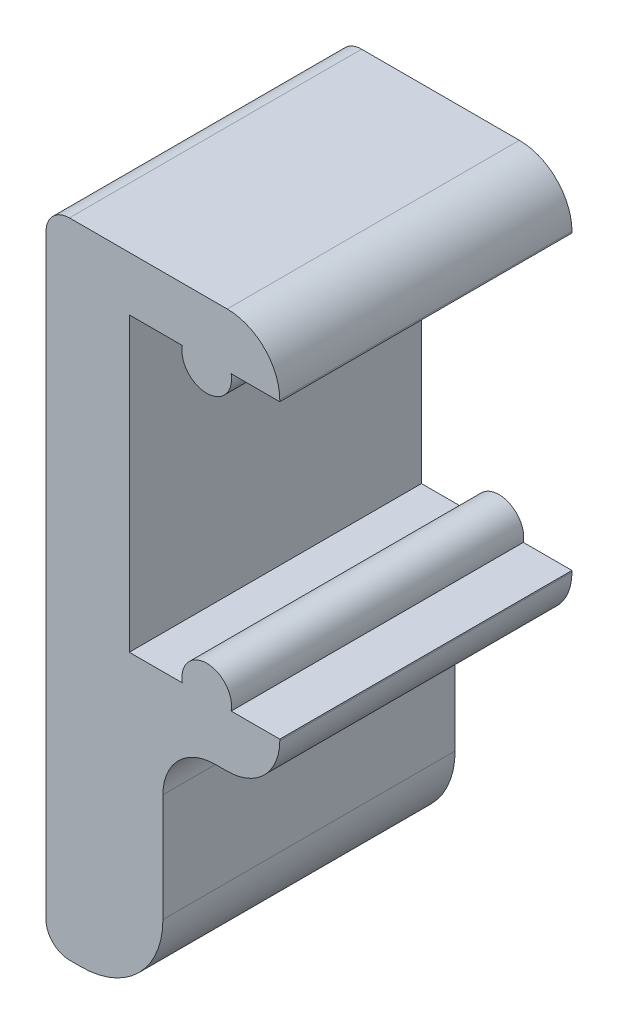
ISO-10303-21;
HEADER;
FILE_DESCRIPTION(('STEP AP214'),'2;1');
FILE_NAME('part.step','',(''),(''),'','','');
FILE_SCHEMA(('AUTOMOTIVE_DESIGN { 1 0 10303 214 1 1 1 1 }'));
ENDSEC;
DATA;
#1=APPLICATION_CONTEXT('core data for automotive mechanical design processes');
#2=APPLICATION_PROTOCOL_DEFINITION('international standard','automotive_design',2000,#1);
#3=PRODUCT_CONTEXT('',#1,'mechanical');
#4=PRODUCT('Part','Part','',(#3));
#5=PRODUCT_RELATED_PRODUCT_CATEGORY('part','',(#4));
#6=PRODUCT_DEFINITION_FORMATION('','',#4);
#7=PRODUCT_DEFINITION_CONTEXT('part definition',#1,'design');
#8=PRODUCT_DEFINITION('design','',#6,#7);
#9=PRODUCT_DEFINITION_SHAPE('','',#8);
#10=(LENGTH_UNIT() NAMED_UNIT(*) SI_UNIT(.MILLI.,.METRE.));
#11=(NAMED_UNIT(*) PLANE_ANGLE_UNIT() SI_UNIT($,.RADIAN.));
#12=(NAMED_UNIT(*) SI_UNIT($,.STERADIAN.) SOLID_ANGLE_UNIT());
#13=UNCERTAINTY_MEASURE_WITH_UNIT(LENGTH_MEASURE(1.E-05),#10,'distance_accuracy_value','');
#14=(GEOMETRIC_REPRESENTATION_CONTEXT(3) GLOBAL_UNCERTAINTY_ASSIGNED_CONTEXT((#13)) GLOBAL_UNIT_ASSIGNED_CONTEXT((#10,
#11,#12)) REPRESENTATION_CONTEXT('',''));
#15=CARTESIAN_POINT('',(0.,0.,0.));
#16=DIRECTION('',(0.,0.,1.));
#17=DIRECTION('',(1.,0.,0.));
#18=AXIS2_PLACEMENT_3D('',#15,#16,#17);
#19=CARTESIAN_POINT('',(0.8,0.8,10.));
#20=DIRECTION('',(0.,0.,-1.));
#21=DIRECTION('',(-1.,0.,0.));
#22=AXIS2_PLACEMENT_3D('',#19,#20,#21);
#23=CYLINDRICAL_SURFACE('',#22,0.8);
#24=CARTESIAN_POINT('',(0.8,0.8,0.));
#25=DIRECTION('',(0.,0.,1.));
#26=DIRECTION('',(1.,0.,0.));
#27=AXIS2_PLACEMENT_3D('',#24,#25,#26);
#28=CIRCLE('',#27,0.8);
#29=CARTESIAN_POINT('',(0.800000000000006,0.,0.));
#30=VERTEX_POINT('',#29);
#31=CARTESIAN_POINT('',(0.,0.800000000000006,0.));
#32=VERTEX_POINT('',#31);
#33=EDGE_CURVE('E201',#30,#32,#28,.F.);
#34=ORIENTED_EDGE('',*,*,#33,.F.);
#35=DIRECTION('',(0.,0.,-1.));
#36=VECTOR('',#35,1.);
#37=CARTESIAN_POINT('',(0.800000000000006,0.,10.));
#38=LINE('',#37,#36);
#39=CARTESIAN_POINT('',(0.800000000000006,0.,10.));
#40=VERTEX_POINT('',#39);
#41=EDGE_CURVE('E11',#40,#30,#38,.T.);
#42=ORIENTED_EDGE('',*,*,#41,.F.);
#43=CARTESIAN_POINT('',(0.8,0.8,10.));
#44=DIRECTION('',(0.,0.,1.));
#45=DIRECTION('',(1.,0.,0.));
#46=AXIS2_PLACEMENT_3D('',#43,#44,#45);
#47=CIRCLE('',#46,0.8);
#48=CARTESIAN_POINT('',(0.,0.800000000000006,10.));
#49=VERTEX_POINT('',#48);
#50=EDGE_CURVE('E253',#40,#49,#47,.F.);
#51=ORIENTED_EDGE('',*,*,#50,.T.);
#52=DIRECTION('',(0.,0.,-1.));
#53=VECTOR('',#52,1.);
#54=CARTESIAN_POINT('',(0.,0.800000000000006,10.));
#55=LINE('',#54,#53);
#56=EDGE_CURVE('E52',#49,#32,#55,.T.);
#57=ORIENTED_EDGE('',*,*,#56,.T.);
#58=EDGE_LOOP('',(#34,#42,#51,#57));
#59=FACE_BOUND('',#58,.T.);
#60=ADVANCED_FACE('F36',(#59),#23,.T.);
#61=CARTESIAN_POINT('',(0.,0.,10.));
#62=DIRECTION('',(0.,-1.,0.));
#63=DIRECTION('',(1.,0.,0.));
#64=AXIS2_PLACEMENT_3D('',#61,#62,#63);
#65=PLANE('',#64);
#66=DIRECTION('',(-1.,0.,0.));
#67=VECTOR('',#66,1.);
#68=CARTESIAN_POINT('',(0.,0.,0.));
#69=LINE('',#68,#67);
#70=CARTESIAN_POINT('',(1.2,0.,0.));
#71=VERTEX_POINT('',#70);
#72=EDGE_CURVE('E203',#71,#30,#69,.T.);
#73=ORIENTED_EDGE('',*,*,#72,.F.);
#74=DIRECTION('',(0.,0.,-1.));
#75=VECTOR('',#74,1.);
#76=CARTESIAN_POINT('',(1.2,0.,10.));
#77=LINE('',#76,#75);
#78=CARTESIAN_POINT('',(1.2,0.,10.));
#79=VERTEX_POINT('',#78);
#80=EDGE_CURVE('E44',#79,#71,#77,.T.);
#81=ORIENTED_EDGE('',*,*,#80,.F.);
#82=DIRECTION('',(-1.,0.,0.));
#83=VECTOR('',#82,1.);
#84=CARTESIAN_POINT('',(0.,0.,10.));
#85=LINE('',#84,#83);
#86=EDGE_CURVE('E305',#79,#40,#85,.T.);
#87=ORIENTED_EDGE('',*,*,#86,.T.);
#88=ORIENTED_EDGE('',*,*,#41,.T.);
#89=EDGE_LOOP('',(#73,#81,#87,#88));
#90=FACE_BOUND('',#89,.T.);
#91=ADVANCED_FACE('F294',(#90),#65,.T.);
#92=CARTESIAN_POINT('',(1.2,2.8,10.));
#93=DIRECTION('',(0.,0.,-1.));
#94=DIRECTION('',(-1.,0.,0.));
#95=AXIS2_PLACEMENT_3D('',#92,#93,#94);
#96=CYLINDRICAL_SURFACE('',#95,2.8);
#97=CARTESIAN_POINT('',(1.2,2.8,0.));
#98=DIRECTION('',(0.,0.,1.));
#99=DIRECTION('',(1.,0.,0.));
#100=AXIS2_PLACEMENT_3D('',#97,#98,#99);
#101=CIRCLE('',#100,2.8);
#102=CARTESIAN_POINT('',(4.,2.8,0.));
#103=VERTEX_POINT('',#102);
#104=EDGE_CURVE('E206',#103,#71,#101,.F.);
#105=ORIENTED_EDGE('',*,*,#104,.F.);
#106=DIRECTION('',(0.,0.,-1.));
#107=VECTOR('',#106,1.);
#108=CARTESIAN_POINT('',(4.,2.8,10.));
#109=LINE('',#108,#107);
#110=CARTESIAN_POINT('',(4.,2.8,10.));
#111=VERTEX_POINT('',#110);
#112=EDGE_CURVE('E283',#111,#103,#109,.T.);
#113=ORIENTED_EDGE('',*,*,#112,.F.);
#114=CARTESIAN_POINT('',(1.2,2.8,10.));
#115=DIRECTION('',(0.,0.,1.));
#116=DIRECTION('',(1.,0.,0.));
#117=AXIS2_PLACEMENT_3D('',#114,#115,#116);
#118=CIRCLE('',#117,2.8);
#119=EDGE_CURVE('E290',#111,#79,#118,.F.);
#120=ORIENTED_EDGE('',*,*,#119,.T.);
#121=ORIENTED_EDGE('',*,*,#80,.T.);
#122=EDGE_LOOP('',(#105,#113,#120,#121));
#123=FACE_BOUND('',#122,.T.);
#124=ADVANCED_FACE('F288',(#123),#96,.T.);
#125=CARTESIAN_POINT('',(4.,0.,10.));
#126=DIRECTION('',(1.,0.,0.));
#127=DIRECTION('',(0.,1.,0.));
#128=AXIS2_PLACEMENT_3D('',#125,#126,#127);
#129=PLANE('',#128);
#130=DIRECTION('',(0.,-1.,0.));
#131=VECTOR('',#130,1.);
#132=CARTESIAN_POINT('',(4.,0.,0.));
#133=LINE('',#132,#131);
#134=CARTESIAN_POINT('',(4.,6.49999999999999,0.));
#135=VERTEX_POINT('',#134);
#136=EDGE_CURVE('E209',#135,#103,#133,.T.);
#137=ORIENTED_EDGE('',*,*,#136,.F.);
#138=DIRECTION('',(0.,0.,-1.));
#139=VECTOR('',#138,1.);
#140=CARTESIAN_POINT('',(4.,6.49999999999999,10.));
#141=LINE('',#140,#139);
#142=CARTESIAN_POINT('',(4.,6.49999999999999,10.));
#143=VERTEX_POINT('',#142);
#144=EDGE_CURVE('E281',#143,#135,#141,.T.);
#145=ORIENTED_EDGE('',*,*,#144,.F.);
#146=DIRECTION('',(0.,-1.,0.));
#147=VECTOR('',#146,1.);
#148=CARTESIAN_POINT('',(4.,0.,10.));
#149=LINE('',#148,#147);
#150=EDGE_CURVE('E304',#143,#111,#149,.T.);
#151=ORIENTED_EDGE('',*,*,#150,.T.);
#152=ORIENTED_EDGE('',*,*,#112,.T.);
#153=EDGE_LOOP('',(#137,#145,#151,#152));
#154=FACE_BOUND('',#153,.T.);
#155=ADVANCED_FACE('F300',(#154),#129,.T.);
#156=CARTESIAN_POINT('',(5.8,6.49999999999999,10.));
#157=DIRECTION('',(0.,0.,-1.));
#158=DIRECTION('',(-1.,0.,0.));
#159=AXIS2_PLACEMENT_3D('',#156,#157,#158);
#160=CYLINDRICAL_SURFACE('',#159,1.8);
#161=CARTESIAN_POINT('',(5.8,6.49999999999999,0.));
#162=DIRECTION('',(0.,0.,1.));
#163=DIRECTION('',(1.,0.,0.));
#164=AXIS2_PLACEMENT_3D('',#161,#162,#163);
#165=CIRCLE('',#164,1.8);
#166=CARTESIAN_POINT('',(5.8,8.29999999999999,0.));
#167=VERTEX_POINT('',#166);
#168=EDGE_CURVE('E212',#135,#167,#165,.F.);
#169=ORIENTED_EDGE('',*,*,#168,.T.);
#170=DIRECTION('',(0.,0.,-1.));
#171=VECTOR('',#170,1.);
#172=CARTESIAN_POINT('',(5.8,8.29999999999999,10.));
#173=LINE('',#172,#171);
#174=CARTESIAN_POINT('',(5.8,8.29999999999999,10.));
#175=VERTEX_POINT('',#174);
#176=EDGE_CURVE('E279',#175,#167,#173,.T.);
#177=ORIENTED_EDGE('',*,*,#176,.F.);
#178=CARTESIAN_POINT('',(5.8,6.49999999999999,10.));
#179=DIRECTION('',(0.,0.,1.));
#180=DIRECTION('',(1.,0.,0.));
#181=AXIS2_PLACEMENT_3D('',#178,#179,#180);
#182=CIRCLE('',#181,1.8);
#183=EDGE_CURVE('E307',#143,#175,#182,.F.);
#184=ORIENTED_EDGE('',*,*,#183,.F.);
#185=ORIENTED_EDGE('',*,*,#144,.T.);
#186=EDGE_LOOP('',(#169,#177,#184,#185));
#187=FACE_BOUND('',#186,.T.);
#188=ADVANCED_FACE('F380',(#187),#160,.F.);
#189=CARTESIAN_POINT('',(0.,8.29999999999997,10.));
#190=DIRECTION('',(0.,-1.,0.));
#191=DIRECTION('',(1.,0.,0.));
#192=AXIS2_PLACEMENT_3D('',#189,#190,#191);
#193=PLANE('',#192);
#194=DIRECTION('',(-1.,0.,0.));
#195=VECTOR('',#194,1.);
#196=CARTESIAN_POINT('',(0.,8.29999999999997,0.));
#197=LINE('',#196,#195);
#198=CARTESIAN_POINT('',(6.2,8.29999999999999,0.));
#199=VERTEX_POINT('',#198);
#200=EDGE_CURVE('E215',#199,#167,#197,.T.);
#201=ORIENTED_EDGE('',*,*,#200,.F.);
#202=DIRECTION('',(0.,0.,-1.));
#203=VECTOR('',#202,1.);
#204=CARTESIAN_POINT('',(6.2,8.29999999999999,10.));
#205=LINE('',#204,#203);
#206=CARTESIAN_POINT('',(6.2,8.29999999999999,10.));
#207=VERTEX_POINT('',#206);
#208=EDGE_CURVE('E277',#207,#199,#205,.T.);
#209=ORIENTED_EDGE('',*,*,#208,.F.);
#210=DIRECTION('',(-1.,0.,0.));
#211=VECTOR('',#210,1.);
#212=CARTESIAN_POINT('',(0.,8.29999999999997,10.));
#213=LINE('',#212,#211);
#214=EDGE_CURVE('E313',#207,#175,#213,.T.);
#215=ORIENTED_EDGE('',*,*,#214,.T.);
#216=ORIENTED_EDGE('',*,*,#176,.T.);
#217=EDGE_LOOP('',(#201,#209,#215,#216));
#218=FACE_BOUND('',#217,.T.);
#219=ADVANCED_FACE('F383',(#218),#193,.T.);
#220=CARTESIAN_POINT('',(6.2,10.1,10.));
#221=DIRECTION('',(0.,0.,-1.));
#222=DIRECTION('',(-1.,0.,0.));
#223=AXIS2_PLACEMENT_3D('',#220,#221,#222);
#224=CYLINDRICAL_SURFACE('',#223,1.8);
#225=CARTESIAN_POINT('',(6.2,10.1,0.));
#226=DIRECTION('',(0.,0.,1.));
#227=DIRECTION('',(1.,0.,0.));
#228=AXIS2_PLACEMENT_3D('',#225,#226,#227);
#229=CIRCLE('',#228,1.8);
#230=CARTESIAN_POINT('',(8.,10.1,0.));
#231=VERTEX_POINT('',#230);
#232=EDGE_CURVE('E218',#199,#231,#229,.T.);
#233=ORIENTED_EDGE('',*,*,#232,.T.);
#234=DIRECTION('',(0.,0.,-1.));
#235=VECTOR('',#234,1.);
#236=CARTESIAN_POINT('',(8.,10.1,10.));
#237=LINE('',#236,#235);
#238=CARTESIAN_POINT('',(8.,10.1,10.));
#239=VERTEX_POINT('',#238);
#240=EDGE_CURVE('E275',#239,#231,#237,.T.);
#241=ORIENTED_EDGE('',*,*,#240,.F.);
#242=CARTESIAN_POINT('',(6.2,10.1,10.));
#243=DIRECTION('',(0.,0.,1.));
#244=DIRECTION('',(1.,0.,0.));
#245=AXIS2_PLACEMENT_3D('',#242,#243,#244);
#246=CIRCLE('',#245,1.8);
#247=EDGE_CURVE('E316',#207,#239,#246,.T.);
#248=ORIENTED_EDGE('',*,*,#247,.F.);
#249=ORIENTED_EDGE('',*,*,#208,.T.);
#250=EDGE_LOOP('',(#233,#241,#248,#249));
#251=FACE_BOUND('',#250,.T.);
#252=ADVANCED_FACE('F387',(#251),#224,.T.);
#253=CARTESIAN_POINT('',(8.,0.,10.));
#254=DIRECTION('',(1.,0.,0.));
#255=DIRECTION('',(0.,0.,-1.));
#256=AXIS2_PLACEMENT_3D('',#253,#254,#255);
#257=PLANE('',#256);
#258=DIRECTION('',(0.,-1.,0.));
#259=VECTOR('',#258,1.);
#260=CARTESIAN_POINT('',(8.,0.,0.));
#261=LINE('',#260,#259);
#262=CARTESIAN_POINT('',(8.,10.15,0.));
#263=VERTEX_POINT('',#262);
#264=EDGE_CURVE('E221',#263,#231,#261,.T.);
#265=ORIENTED_EDGE('',*,*,#264,.F.);
#266=DIRECTION('',(0.,0.,-1.));
#267=VECTOR('',#266,1.);
#268=CARTESIAN_POINT('',(8.,10.15,10.));
#269=LINE('',#268,#267);
#270=CARTESIAN_POINT('',(8.,10.15,10.));
#271=VERTEX_POINT('',#270);
#272=EDGE_CURVE('E273',#271,#263,#269,.T.);
#273=ORIENTED_EDGE('',*,*,#272,.F.);
#274=DIRECTION('',(0.,-1.,0.));
#275=VECTOR('',#274,1.);
#276=CARTESIAN_POINT('',(8.,0.,10.));
#277=LINE('',#276,#275);
#278=EDGE_CURVE('E318',#271,#239,#277,.T.);
#279=ORIENTED_EDGE('',*,*,#278,.T.);
#280=ORIENTED_EDGE('',*,*,#240,.T.);
#281=EDGE_LOOP('',(#265,#273,#279,#280));
#282=FACE_BOUND('',#281,.T.);
#283=ADVANCED_FACE('F391',(#282),#257,.T.);
#284=CARTESIAN_POINT('',(0.,10.15,10.));
#285=DIRECTION('',(0.,1.,0.));
#286=DIRECTION('',(0.,0.,1.));
#287=AXIS2_PLACEMENT_3D('',#284,#285,#286);
#288=PLANE('',#287);
#289=DIRECTION('',(1.,0.,0.));
#290=VECTOR('',#289,1.);
#291=CARTESIAN_POINT('',(0.,10.15,0.));
#292=LINE('',#291,#290);
#293=CARTESIAN_POINT('',(6.33666002653408,10.15,0.));
#294=VERTEX_POINT('',#293);
#295=EDGE_CURVE('E224',#294,#263,#292,.T.);
#296=ORIENTED_EDGE('',*,*,#295,.F.);
#297=DIRECTION('',(0.,0.,-1.));
#298=VECTOR('',#297,1.);
#299=CARTESIAN_POINT('',(6.33666002653408,10.15,10.));
#300=LINE('',#299,#298);
#301=CARTESIAN_POINT('',(6.33666002653408,10.15,10.));
#302=VERTEX_POINT('',#301);
#303=EDGE_CURVE('E271',#302,#294,#300,.T.);
#304=ORIENTED_EDGE('',*,*,#303,.F.);
#305=DIRECTION('',(1.,0.,0.));
#306=VECTOR('',#305,1.);
#307=CARTESIAN_POINT('',(0.,10.15,10.));
#308=LINE('',#307,#306);
#309=EDGE_CURVE('E321',#302,#271,#308,.T.);
#310=ORIENTED_EDGE('',*,*,#309,.T.);
#311=ORIENTED_EDGE('',*,*,#272,.T.);
#312=EDGE_LOOP('',(#296,#304,#310,#311));
#313=FACE_BOUND('',#312,.T.);
#314=ADVANCED_FACE('F395',(#313),#288,.T.);
#315=CARTESIAN_POINT('',(5.5,10.3,10.));
#316=DIRECTION('',(0.,0.,-1.));
#317=DIRECTION('',(-1.,0.,0.));
#318=AXIS2_PLACEMENT_3D('',#315,#316,#317);
#319=CYLINDRICAL_SURFACE('',#318,0.85);
#320=CARTESIAN_POINT('',(5.5,10.3,0.));
#321=DIRECTION('',(0.,0.,1.));
#322=DIRECTION('',(1.,0.,0.));
#323=AXIS2_PLACEMENT_3D('',#320,#321,#322);
#324=CIRCLE('',#323,0.85);
#325=CARTESIAN_POINT('',(4.66333997346592,10.15,0.));
#326=VERTEX_POINT('',#325);
#327=EDGE_CURVE('E227',#326,#294,#324,.F.);
#328=ORIENTED_EDGE('',*,*,#327,.F.);
#329=DIRECTION('',(0.,0.,-1.));
#330=VECTOR('',#329,1.);
#331=CARTESIAN_POINT('',(4.66333997346592,10.15,10.));
#332=LINE('',#331,#330);
#333=CARTESIAN_POINT('',(4.66333997346592,10.15,10.));
#334=VERTEX_POINT('',#333);
#335=EDGE_CURVE('E269',#334,#326,#332,.T.);
#336=ORIENTED_EDGE('',*,*,#335,.F.);
#337=CARTESIAN_POINT('',(5.5,10.3,10.));
#338=DIRECTION('',(0.,0.,1.));
#339=DIRECTION('',(1.,0.,0.));
#340=AXIS2_PLACEMENT_3D('',#337,#338,#339);
#341=CIRCLE('',#340,0.85);
#342=EDGE_CURVE('E324',#334,#302,#341,.F.);
#343=ORIENTED_EDGE('',*,*,#342,.T.);
#344=ORIENTED_EDGE('',*,*,#303,.T.);
#345=EDGE_LOOP('',(#328,#336,#343,#344));
#346=FACE_BOUND('',#345,.T.);
#347=ADVANCED_FACE('F397',(#346),#319,.T.);
#348=CARTESIAN_POINT('',(2.85,10.15,0.));
#349=VERTEX_POINT('',#348);
#350=EDGE_CURVE('E228',#349,#326,#292,.T.);
#351=ORIENTED_EDGE('',*,*,#350,.F.);
#352=DIRECTION('',(0.,0.,-1.));
#353=VECTOR('',#352,1.);
#354=CARTESIAN_POINT('',(2.85,10.15,10.));
#355=LINE('',#354,#353);
#356=CARTESIAN_POINT('',(2.85,10.15,10.));
#357=VERTEX_POINT('',#356);
#358=EDGE_CURVE('E267',#357,#349,#355,.T.);
#359=ORIENTED_EDGE('',*,*,#358,.F.);
#360=EDGE_CURVE('E325',#357,#334,#308,.T.);
#361=ORIENTED_EDGE('',*,*,#360,.T.);
#362=ORIENTED_EDGE('',*,*,#335,.T.);
#363=EDGE_LOOP('',(#351,#359,#361,#362));
#364=FACE_BOUND('',#363,.T.);
#365=ADVANCED_FACE('F400',(#364),#288,.T.);
#366=CARTESIAN_POINT('',(2.85,0.,10.));
#367=DIRECTION('',(1.,0.,0.));
#368=DIRECTION('',(0.,1.,0.));
#369=AXIS2_PLACEMENT_3D('',#366,#367,#368);
#370=PLANE('',#369);
#371=DIRECTION('',(0.,-1.,0.));
#372=VECTOR('',#371,1.);
#373=CARTESIAN_POINT('',(2.85,0.,0.));
#374=LINE('',#373,#372);
#375=CARTESIAN_POINT('',(2.85,20.15,0.));
#376=VERTEX_POINT('',#375);
#377=EDGE_CURVE('E231',#376,#349,#374,.T.);
#378=ORIENTED_EDGE('',*,*,#377,.F.);
#379=DIRECTION('',(0.,0.,-1.));
#380=VECTOR('',#379,1.);
#381=CARTESIAN_POINT('',(2.85,20.15,10.));
#382=LINE('',#381,#380);
#383=CARTESIAN_POINT('',(2.85,20.15,10.));
#384=VERTEX_POINT('',#383);
#385=EDGE_CURVE('E265',#384,#376,#382,.T.);
#386=ORIENTED_EDGE('',*,*,#385,.F.);
#387=DIRECTION('',(0.,-1.,0.));
#388=VECTOR('',#387,1.);
#389=CARTESIAN_POINT('',(2.85,0.,10.));
#390=LINE('',#389,#388);
#391=EDGE_CURVE('E328',#384,#357,#390,.T.);
#392=ORIENTED_EDGE('',*,*,#391,.T.);
#393=ORIENTED_EDGE('',*,*,#358,.T.);
#394=EDGE_LOOP('',(#378,#386,#392,#393));
#395=FACE_BOUND('',#394,.T.);
#396=ADVANCED_FACE('F404',(#395),#370,.T.);
#397=CARTESIAN_POINT('',(0.,20.15,10.));
#398=DIRECTION('',(0.,-1.,0.));
#399=DIRECTION('',(1.,0.,0.));
#400=AXIS2_PLACEMENT_3D('',#397,#398,#399);
#401=PLANE('',#400);
#402=DIRECTION('',(-1.,0.,0.));
#403=VECTOR('',#402,1.);
#404=CARTESIAN_POINT('',(0.,20.15,0.));
#405=LINE('',#404,#403);
#406=CARTESIAN_POINT('',(4.66333997346592,20.15,0.));
#407=VERTEX_POINT('',#406);
#408=EDGE_CURVE('E234',#407,#376,#405,.T.);
#409=ORIENTED_EDGE('',*,*,#408,.F.);
#410=DIRECTION('',(0.,0.,-1.));
#411=VECTOR('',#410,1.);
#412=CARTESIAN_POINT('',(4.66333997346592,20.15,10.));
#413=LINE('',#412,#411);
#414=CARTESIAN_POINT('',(4.66333997346592,20.15,10.));
#415=VERTEX_POINT('',#414);
#416=EDGE_CURVE('E263',#415,#407,#413,.T.);
#417=ORIENTED_EDGE('',*,*,#416,.F.);
#418=DIRECTION('',(-1.,0.,0.));
#419=VECTOR('',#418,1.);
#420=CARTESIAN_POINT('',(0.,20.15,10.));
#421=LINE('',#420,#419);
#422=EDGE_CURVE('E331',#415,#384,#421,.T.);
#423=ORIENTED_EDGE('',*,*,#422,.T.);
#424=ORIENTED_EDGE('',*,*,#385,.T.);
#425=EDGE_LOOP('',(#409,#417,#423,#424));
#426=FACE_BOUND('',#425,.T.);
#427=ADVANCED_FACE('F408',(#426),#401,.T.);
#428=CARTESIAN_POINT('',(5.5,20.,10.));
#429=DIRECTION('',(0.,0.,-1.));
#430=DIRECTION('',(-1.,0.,0.));
#431=AXIS2_PLACEMENT_3D('',#428,#429,#430);
#432=CYLINDRICAL_SURFACE('',#431,0.85);
#433=CARTESIAN_POINT('',(5.5,20.,0.));
#434=DIRECTION('',(0.,0.,1.));
#435=DIRECTION('',(1.,0.,0.));
#436=AXIS2_PLACEMENT_3D('',#433,#434,#435);
#437=CIRCLE('',#436,0.85);
#438=CARTESIAN_POINT('',(6.33666002653408,20.15,0.));
#439=VERTEX_POINT('',#438);
#440=EDGE_CURVE('E237',#407,#439,#437,.T.);
#441=ORIENTED_EDGE('',*,*,#440,.T.);
#442=DIRECTION('',(0.,0.,-1.));
#443=VECTOR('',#442,1.);
#444=CARTESIAN_POINT('',(6.33666002653408,20.15,10.));
#445=LINE('',#444,#443);
#446=CARTESIAN_POINT('',(6.33666002653408,20.15,10.));
#447=VERTEX_POINT('',#446);
#448=EDGE_CURVE('E261',#447,#439,#445,.T.);
#449=ORIENTED_EDGE('',*,*,#448,.F.);
#450=CARTESIAN_POINT('',(5.5,20.,10.));
#451=DIRECTION('',(0.,0.,1.));
#452=DIRECTION('',(1.,0.,0.));
#453=AXIS2_PLACEMENT_3D('',#450,#451,#452);
#454=CIRCLE('',#453,0.85);
#455=EDGE_CURVE('E334',#415,#447,#454,.T.);
#456=ORIENTED_EDGE('',*,*,#455,.F.);
#457=ORIENTED_EDGE('',*,*,#416,.T.);
#458=EDGE_LOOP('',(#441,#449,#456,#457));
#459=FACE_BOUND('',#458,.T.);
#460=ADVANCED_FACE('F350',(#459),#432,.T.);
#461=CARTESIAN_POINT('',(8.,20.15,0.));
#462=VERTEX_POINT('',#461);
#463=EDGE_CURVE('E238',#462,#439,#405,.T.);
#464=ORIENTED_EDGE('',*,*,#463,.F.);
#465=DIRECTION('',(0.,0.,-1.));
#466=VECTOR('',#465,1.);
#467=CARTESIAN_POINT('',(8.,20.15,10.));
#468=LINE('',#467,#466);
#469=CARTESIAN_POINT('',(8.,20.15,10.));
#470=VERTEX_POINT('',#469);
#471=EDGE_CURVE('E259',#470,#462,#468,.T.);
#472=ORIENTED_EDGE('',*,*,#471,.F.);
#473=EDGE_CURVE('E335',#470,#447,#421,.T.);
#474=ORIENTED_EDGE('',*,*,#473,.T.);
#475=ORIENTED_EDGE('',*,*,#448,.T.);
#476=EDGE_LOOP('',(#464,#472,#474,#475));
#477=FACE_BOUND('',#476,.T.);
#478=ADVANCED_FACE('F344',(#477),#401,.T.);
#479=CARTESIAN_POINT('',(8.,0.,10.));
#480=DIRECTION('',(1.,0.,0.));
#481=DIRECTION('',(0.,0.,-1.));
#482=AXIS2_PLACEMENT_3D('',#479,#480,#481);
#483=PLANE('',#482);
#484=DIRECTION('',(0.,-1.,0.));
#485=VECTOR('',#484,1.);
#486=CARTESIAN_POINT('',(8.,0.,0.));
#487=LINE('',#486,#485);
#488=CARTESIAN_POINT('',(8.,20.2,0.));
#489=VERTEX_POINT('',#488);
#490=EDGE_CURVE('E241',#489,#462,#487,.T.);
#491=ORIENTED_EDGE('',*,*,#490,.F.);
#492=DIRECTION('',(0.,0.,-1.));
#493=VECTOR('',#492,1.);
#494=CARTESIAN_POINT('',(8.,20.2,10.));
#495=LINE('',#494,#493);
#496=CARTESIAN_POINT('',(8.,20.2,10.));
#497=VERTEX_POINT('',#496);
#498=EDGE_CURVE('E257',#497,#489,#495,.T.);
#499=ORIENTED_EDGE('',*,*,#498,.F.);
#500=DIRECTION('',(0.,-1.,0.));
#501=VECTOR('',#500,1.);
#502=CARTESIAN_POINT('',(8.,0.,10.));
#503=LINE('',#502,#501);
#504=EDGE_CURVE('E337',#497,#470,#503,.T.);
#505=ORIENTED_EDGE('',*,*,#504,.T.);
#506=ORIENTED_EDGE('',*,*,#471,.T.);
#507=EDGE_LOOP('',(#491,#499,#505,#506));
#508=FACE_BOUND('',#507,.T.);
#509=ADVANCED_FACE('F356',(#508),#483,.T.);
#510=CARTESIAN_POINT('',(6.2,20.2,10.));
#511=DIRECTION('',(0.,0.,-1.));
#512=DIRECTION('',(-1.,0.,0.));
#513=AXIS2_PLACEMENT_3D('',#510,#511,#512);
#514=CYLINDRICAL_SURFACE('',#513,1.8);
#515=CARTESIAN_POINT('',(6.2,20.2,0.));
#516=DIRECTION('',(0.,0.,1.));
#517=DIRECTION('',(1.,0.,0.));
#518=AXIS2_PLACEMENT_3D('',#515,#516,#517);
#519=CIRCLE('',#518,1.8);
#520=CARTESIAN_POINT('',(6.19999999999998,22.,0.));
#521=VERTEX_POINT('',#520);
#522=EDGE_CURVE('E244',#489,#521,#519,.T.);
#523=ORIENTED_EDGE('',*,*,#522,.T.);
#524=DIRECTION('',(0.,0.,-1.));
#525=VECTOR('',#524,1.);
#526=CARTESIAN_POINT('',(6.19999999999998,22.,10.));
#527=LINE('',#526,#525);
#528=CARTESIAN_POINT('',(6.19999999999998,22.,10.));
#529=VERTEX_POINT('',#528);
#530=EDGE_CURVE('E183',#529,#521,#527,.T.);
#531=ORIENTED_EDGE('',*,*,#530,.F.);
#532=CARTESIAN_POINT('',(6.2,20.2,10.));
#533=DIRECTION('',(0.,0.,1.));
#534=DIRECTION('',(1.,0.,0.));
#535=AXIS2_PLACEMENT_3D('',#532,#533,#534);
#536=CIRCLE('',#535,1.8);
#537=EDGE_CURVE('E192',#497,#529,#536,.T.);
#538=ORIENTED_EDGE('',*,*,#537,.F.);
#539=ORIENTED_EDGE('',*,*,#498,.T.);
#540=EDGE_LOOP('',(#523,#531,#538,#539));
#541=FACE_BOUND('',#540,.T.);
#542=ADVANCED_FACE('F358',(#541),#514,.T.);
#543=CARTESIAN_POINT('',(0.,22.,10.));
#544=DIRECTION('',(0.,1.,0.));
#545=DIRECTION('',(-1.,0.,0.));
#546=AXIS2_PLACEMENT_3D('',#543,#544,#545);
#547=PLANE('',#546);
#548=DIRECTION('',(1.,0.,0.));
#549=VECTOR('',#548,1.);
#550=CARTESIAN_POINT('',(0.,22.,0.));
#551=LINE('',#550,#549);
#552=CARTESIAN_POINT('',(0.800000000000006,22.,0.));
#553=VERTEX_POINT('',#552);
#554=EDGE_CURVE('E179',#553,#521,#551,.T.);
#555=ORIENTED_EDGE('',*,*,#554,.F.);
#556=DIRECTION('',(0.,0.,-1.));
#557=VECTOR('',#556,1.);
#558=CARTESIAN_POINT('',(0.800000000000006,22.,10.));
#559=LINE('',#558,#557);
#560=CARTESIAN_POINT('',(0.800000000000006,22.,10.));
#561=VERTEX_POINT('',#560);
#562=EDGE_CURVE('E174',#561,#553,#559,.T.);
#563=ORIENTED_EDGE('',*,*,#562,.F.);
#564=DIRECTION('',(1.,0.,0.));
#565=VECTOR('',#564,1.);
#566=CARTESIAN_POINT('',(0.,22.,10.));
#567=LINE('',#566,#565);
#568=EDGE_CURVE('E177',#561,#529,#567,.T.);
#569=ORIENTED_EDGE('',*,*,#568,.T.);
#570=ORIENTED_EDGE('',*,*,#530,.T.);
#571=EDGE_LOOP('',(#555,#563,#569,#570));
#572=FACE_BOUND('',#571,.T.);
#573=ADVANCED_FACE('F176',(#572),#547,.T.);
#574=CARTESIAN_POINT('',(0.8,21.2,10.));
#575=DIRECTION('',(0.,0.,-1.));
#576=DIRECTION('',(-1.,0.,0.));
#577=AXIS2_PLACEMENT_3D('',#574,#575,#576);
#578=CYLINDRICAL_SURFACE('',#577,0.800000000000001);
#579=CARTESIAN_POINT('',(0.8,21.2,0.));
#580=DIRECTION('',(0.,0.,1.));
#581=DIRECTION('',(1.,0.,0.));
#582=AXIS2_PLACEMENT_3D('',#579,#580,#581);
#583=CIRCLE('',#582,0.800000000000001);
#584=CARTESIAN_POINT('',(0.,21.2,0.));
#585=VERTEX_POINT('',#584);
#586=EDGE_CURVE('E248',#585,#553,#583,.F.);
#587=ORIENTED_EDGE('',*,*,#586,.F.);
#588=DIRECTION('',(0.,0.,-1.));
#589=VECTOR('',#588,1.);
#590=CARTESIAN_POINT('',(0.,21.2,10.));
#591=LINE('',#590,#589);
#592=CARTESIAN_POINT('',(0.,21.2,10.));
#593=VERTEX_POINT('',#592);
#594=EDGE_CURVE('E113',#593,#585,#591,.T.);
#595=ORIENTED_EDGE('',*,*,#594,.F.);
#596=CARTESIAN_POINT('',(0.8,21.2,10.));
#597=DIRECTION('',(0.,0.,1.));
#598=DIRECTION('',(1.,0.,0.));
#599=AXIS2_PLACEMENT_3D('',#596,#597,#598);
#600=CIRCLE('',#599,0.800000000000001);
#601=EDGE_CURVE('E189',#593,#561,#600,.F.);
#602=ORIENTED_EDGE('',*,*,#601,.T.);
#603=ORIENTED_EDGE('',*,*,#562,.T.);
#604=EDGE_LOOP('',(#587,#595,#602,#603));
#605=FACE_BOUND('',#604,.T.);
#606=ADVANCED_FACE('F195',(#605),#578,.T.);
#607=CARTESIAN_POINT('',(0.,0.,10.));
#608=DIRECTION('',(-1.,0.,0.));
#609=DIRECTION('',(0.,0.,1.));
#610=AXIS2_PLACEMENT_3D('',#607,#608,#609);
#611=PLANE('',#610);
#612=DIRECTION('',(0.,1.,0.));
#613=VECTOR('',#612,1.);
#614=CARTESIAN_POINT('',(0.,0.,0.));
#615=LINE('',#614,#613);
#616=EDGE_CURVE('E250',#32,#585,#615,.T.);
#617=ORIENTED_EDGE('',*,*,#616,.F.);
#618=ORIENTED_EDGE('',*,*,#56,.F.);
#619=DIRECTION('',(0.,1.,0.));
#620=VECTOR('',#619,1.);
#621=CARTESIAN_POINT('',(0.,0.,10.));
#622=LINE('',#621,#620);
#623=EDGE_CURVE('E196',#49,#593,#622,.T.);
#624=ORIENTED_EDGE('',*,*,#623,.T.);
#625=ORIENTED_EDGE('',*,*,#594,.T.);
#626=EDGE_LOOP('',(#617,#618,#624,#625));
#627=FACE_BOUND('',#626,.T.);
#628=ADVANCED_FACE('F359',(#627),#611,.T.);
#629=CARTESIAN_POINT('',(0.,0.,10.));
#630=DIRECTION('',(0.,0.,1.));
#631=DIRECTION('',(1.,0.,0.));
#632=AXIS2_PLACEMENT_3D('',#629,#630,#631);
#633=PLANE('',#632);
#634=ORIENTED_EDGE('',*,*,#50,.F.);
#635=ORIENTED_EDGE('',*,*,#86,.F.);
#636=ORIENTED_EDGE('',*,*,#119,.F.);
#637=ORIENTED_EDGE('',*,*,#150,.F.);
#638=ORIENTED_EDGE('',*,*,#183,.T.);
#639=ORIENTED_EDGE('',*,*,#214,.F.);
#640=ORIENTED_EDGE('',*,*,#247,.T.);
#641=ORIENTED_EDGE('',*,*,#278,.F.);
#642=ORIENTED_EDGE('',*,*,#309,.F.);
#643=ORIENTED_EDGE('',*,*,#342,.F.);
#644=ORIENTED_EDGE('',*,*,#360,.F.);
#645=ORIENTED_EDGE('',*,*,#391,.F.);
#646=ORIENTED_EDGE('',*,*,#422,.F.);
#647=ORIENTED_EDGE('',*,*,#455,.T.);
#648=ORIENTED_EDGE('',*,*,#473,.F.);
#649=ORIENTED_EDGE('',*,*,#504,.F.);
#650=ORIENTED_EDGE('',*,*,#537,.T.);
#651=ORIENTED_EDGE('',*,*,#568,.F.);
#652=ORIENTED_EDGE('',*,*,#601,.F.);
#653=ORIENTED_EDGE('',*,*,#623,.F.);
#654=EDGE_LOOP('',(#634,#635,#636,#637,#638,#639,#640,#641,#642,#643,#644,#645,#646,#647,#648,
#649,#650,#651,#652,#653));
#655=FACE_BOUND('',#654,.T.);
#656=ADVANCED_FACE('F187',(#655),#633,.T.);
#657=CARTESIAN_POINT('',(0.,0.,0.));
#658=DIRECTION('',(0.,0.,1.));
#659=DIRECTION('',(1.,0.,0.));
#660=AXIS2_PLACEMENT_3D('',#657,#658,#659);
#661=PLANE('',#660);
#662=ORIENTED_EDGE('',*,*,#33,.T.);
#663=ORIENTED_EDGE('',*,*,#616,.T.);
#664=ORIENTED_EDGE('',*,*,#586,.T.);
#665=ORIENTED_EDGE('',*,*,#554,.T.);
#666=ORIENTED_EDGE('',*,*,#522,.F.);
#667=ORIENTED_EDGE('',*,*,#490,.T.);
#668=ORIENTED_EDGE('',*,*,#463,.T.);
#669=ORIENTED_EDGE('',*,*,#440,.F.);
#670=ORIENTED_EDGE('',*,*,#408,.T.);
#671=ORIENTED_EDGE('',*,*,#377,.T.);
#672=ORIENTED_EDGE('',*,*,#350,.T.);
#673=ORIENTED_EDGE('',*,*,#327,.T.);
#674=ORIENTED_EDGE('',*,*,#295,.T.);
#675=ORIENTED_EDGE('',*,*,#264,.T.);
#676=ORIENTED_EDGE('',*,*,#232,.F.);
#677=ORIENTED_EDGE('',*,*,#200,.T.);
#678=ORIENTED_EDGE('',*,*,#168,.F.);
#679=ORIENTED_EDGE('',*,*,#136,.T.);
#680=ORIENTED_EDGE('',*,*,#104,.T.);
#681=ORIENTED_EDGE('',*,*,#72,.T.);
#682=EDGE_LOOP('',(#662,#663,#664,#665,#666,#667,#668,#669,#670,#671,#672,#673,#674,#675,#676,
#677,#678,#679,#680,#681));
#683=FACE_BOUND('',#682,.T.);
#684=ADVANCED_FACE('F296',(#683),#661,.F.);
#685=CLOSED_SHELL('',(#60,#91,#124,#155,#188,#219,#252,#283,#314,#347,#365,#396,#427,#460,#478,
#509,#542,#573,#606,#628,#656,#684));
#686=MANIFOLD_SOLID_BREP('B2',#685);
#687=ADVANCED_BREP_SHAPE_REPRESENTATION('',(#18,#686),#14);
#688=SHAPE_DEFINITION_REPRESENTATION(#9,#687);
ENDSEC;
END-ISO-10303-21;
